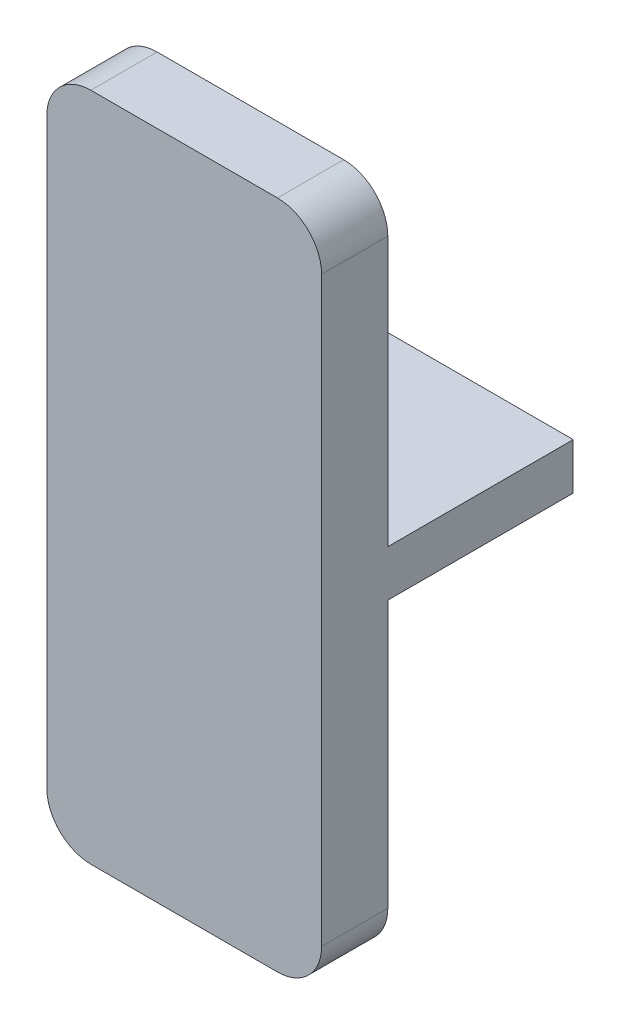
ISO-10303-21;
HEADER;
FILE_DESCRIPTION(('STEP AP214'),'2;1');
FILE_NAME('part.step','',(''),(''),'','','');
FILE_SCHEMA(('AUTOMOTIVE_DESIGN { 1 0 10303 214 1 1 1 1 }'));
ENDSEC;
DATA;
#1=APPLICATION_CONTEXT('core data for automotive mechanical design processes');
#2=APPLICATION_PROTOCOL_DEFINITION('international standard','automotive_design',2000,#1);
#3=PRODUCT_CONTEXT('',#1,'mechanical');
#4=PRODUCT('Part','Part','',(#3));
#5=PRODUCT_RELATED_PRODUCT_CATEGORY('part','',(#4));
#6=PRODUCT_DEFINITION_FORMATION('','',#4);
#7=PRODUCT_DEFINITION_CONTEXT('part definition',#1,'design');
#8=PRODUCT_DEFINITION('design','',#6,#7);
#9=PRODUCT_DEFINITION_SHAPE('','',#8);
#10=(LENGTH_UNIT() NAMED_UNIT(*) SI_UNIT(.MILLI.,.METRE.));
#11=(NAMED_UNIT(*) PLANE_ANGLE_UNIT() SI_UNIT($,.RADIAN.));
#12=(NAMED_UNIT(*) SI_UNIT($,.STERADIAN.) SOLID_ANGLE_UNIT());
#13=UNCERTAINTY_MEASURE_WITH_UNIT(LENGTH_MEASURE(1.E-05),#10,'distance_accuracy_value','');
#14=(GEOMETRIC_REPRESENTATION_CONTEXT(3) GLOBAL_UNCERTAINTY_ASSIGNED_CONTEXT((#13)) GLOBAL_UNIT_ASSIGNED_CONTEXT((#10,
#11,#12)) REPRESENTATION_CONTEXT('',''));
#15=CARTESIAN_POINT('',(0.,0.,0.));
#16=DIRECTION('',(0.,0.,1.));
#17=DIRECTION('',(1.,0.,0.));
#18=AXIS2_PLACEMENT_3D('',#15,#16,#17);
#19=CARTESIAN_POINT('',(0.,0.,8.4));
#20=DIRECTION('',(1.,0.,0.));
#21=DIRECTION('',(0.,0.,-1.));
#22=AXIS2_PLACEMENT_3D('',#19,#20,#21);
#23=PLANE('',#22);
#24=DIRECTION('',(0.,-1.,0.));
#25=VECTOR('',#24,1.);
#26=CARTESIAN_POINT('',(0.,16.2816832821619,8.4));
#27=LINE('',#26,#25);
#28=CARTESIAN_POINT('',(0.,0.,8.4));
#29=VERTEX_POINT('',#28);
#30=CARTESIAN_POINT('',(0.,-12.0863582133201,8.4));
#31=VERTEX_POINT('',#30);
#32=EDGE_CURVE('E132',#29,#31,#27,.T.);
#33=ORIENTED_EDGE('',*,*,#32,.T.);
#34=DIRECTION('',(0.,0.,-1.));
#35=VECTOR('',#34,1.);
#36=CARTESIAN_POINT('',(0.,-12.0863582133201,8.4));
#37=LINE('',#36,#35);
#38=CARTESIAN_POINT('',(0.,-12.0863582133201,11.4));
#39=VERTEX_POINT('',#38);
#40=EDGE_CURVE('E191',#31,#39,#37,.F.);
#41=ORIENTED_EDGE('',*,*,#40,.T.);
#42=DIRECTION('',(0.,-1.,0.));
#43=VECTOR('',#42,1.);
#44=CARTESIAN_POINT('',(0.,16.2816832821619,11.4));
#45=LINE('',#44,#43);
#46=CARTESIAN_POINT('',(0.,14.2816832821619,11.4));
#47=VERTEX_POINT('',#46);
#48=EDGE_CURVE('E217',#47,#39,#45,.T.);
#49=ORIENTED_EDGE('',*,*,#48,.F.);
#50=DIRECTION('',(0.,0.,-1.));
#51=VECTOR('',#50,1.);
#52=CARTESIAN_POINT('',(0.,14.2816832821619,8.4));
#53=LINE('',#52,#51);
#54=CARTESIAN_POINT('',(0.,14.2816832821619,8.4));
#55=VERTEX_POINT('',#54);
#56=EDGE_CURVE('E129',#47,#55,#53,.T.);
#57=ORIENTED_EDGE('',*,*,#56,.T.);
#58=CARTESIAN_POINT('',(0.,2.1,8.4));
#59=VERTEX_POINT('',#58);
#60=EDGE_CURVE('E121',#55,#59,#27,.T.);
#61=ORIENTED_EDGE('',*,*,#60,.T.);
#62=DIRECTION('',(0.,0.,-1.));
#63=VECTOR('',#62,1.);
#64=CARTESIAN_POINT('',(0.,2.1,8.4));
#65=LINE('',#64,#63);
#66=CARTESIAN_POINT('',(0.,2.1,0.));
#67=VERTEX_POINT('',#66);
#68=EDGE_CURVE('E125',#59,#67,#65,.T.);
#69=ORIENTED_EDGE('',*,*,#68,.T.);
#70=DIRECTION('',(0.,-1.,0.));
#71=VECTOR('',#70,1.);
#72=CARTESIAN_POINT('',(0.,0.,0.));
#73=LINE('',#72,#71);
#74=CARTESIAN_POINT('',(0.,0.,0.));
#75=VERTEX_POINT('',#74);
#76=EDGE_CURVE('E153',#67,#75,#73,.T.);
#77=ORIENTED_EDGE('',*,*,#76,.T.);
#78=DIRECTION('',(0.,0.,-1.));
#79=VECTOR('',#78,1.);
#80=CARTESIAN_POINT('',(0.,0.,8.4));
#81=LINE('',#80,#79);
#82=EDGE_CURVE('E165',#29,#75,#81,.T.);
#83=ORIENTED_EDGE('',*,*,#82,.F.);
#84=EDGE_LOOP('',(#33,#41,#49,#57,#61,#69,#77,#83));
#85=FACE_BOUND('',#84,.T.);
#86=ADVANCED_FACE('F33',(#85),#23,.F.);
#87=CARTESIAN_POINT('',(0.,0.,8.4));
#88=DIRECTION('',(0.,1.,0.));
#89=DIRECTION('',(0.,0.,1.));
#90=AXIS2_PLACEMENT_3D('',#87,#88,#89);
#91=PLANE('',#90);
#92=DIRECTION('',(1.,0.,0.));
#93=VECTOR('',#92,1.);
#94=CARTESIAN_POINT('',(0.,0.,0.));
#95=LINE('',#94,#93);
#96=CARTESIAN_POINT('',(12.45,0.,0.));
#97=VERTEX_POINT('',#96);
#98=EDGE_CURVE('E155',#75,#97,#95,.T.);
#99=ORIENTED_EDGE('',*,*,#98,.T.);
#100=DIRECTION('',(0.,0.,-1.));
#101=VECTOR('',#100,1.);
#102=CARTESIAN_POINT('',(12.45,0.,8.4));
#103=LINE('',#102,#101);
#104=CARTESIAN_POINT('',(12.45,0.,8.4));
#105=VERTEX_POINT('',#104);
#106=EDGE_CURVE('E162',#105,#97,#103,.T.);
#107=ORIENTED_EDGE('',*,*,#106,.F.);
#108=DIRECTION('',(1.,0.,0.));
#109=VECTOR('',#108,1.);
#110=CARTESIAN_POINT('',(0.,0.,8.4));
#111=LINE('',#110,#109);
#112=EDGE_CURVE('E147',#29,#105,#111,.T.);
#113=ORIENTED_EDGE('',*,*,#112,.F.);
#114=ORIENTED_EDGE('',*,*,#82,.T.);
#115=EDGE_LOOP('',(#99,#107,#113,#114));
#116=FACE_BOUND('',#115,.T.);
#117=ADVANCED_FACE('F239',(#116),#91,.F.);
#118=CARTESIAN_POINT('',(12.45,0.,8.4));
#119=DIRECTION('',(-1.,0.,0.));
#120=DIRECTION('',(0.,0.,1.));
#121=AXIS2_PLACEMENT_3D('',#118,#119,#120);
#122=PLANE('',#121);
#123=DIRECTION('',(0.,1.,0.));
#124=VECTOR('',#123,1.);
#125=CARTESIAN_POINT('',(12.45,16.2816832821619,11.4));
#126=LINE('',#125,#124);
#127=CARTESIAN_POINT('',(12.45,-12.0863582133201,11.4));
#128=VERTEX_POINT('',#127);
#129=CARTESIAN_POINT('',(12.45,14.2816832821619,11.4));
#130=VERTEX_POINT('',#129);
#131=EDGE_CURVE('E209',#128,#130,#126,.T.);
#132=ORIENTED_EDGE('',*,*,#131,.F.);
#133=DIRECTION('',(0.,0.,-1.));
#134=VECTOR('',#133,1.);
#135=CARTESIAN_POINT('',(12.45,-12.0863582133201,8.4));
#136=LINE('',#135,#134);
#137=CARTESIAN_POINT('',(12.45,-12.0863582133201,8.4));
#138=VERTEX_POINT('',#137);
#139=EDGE_CURVE('E170',#128,#138,#136,.T.);
#140=ORIENTED_EDGE('',*,*,#139,.T.);
#141=DIRECTION('',(0.,1.,0.));
#142=VECTOR('',#141,1.);
#143=CARTESIAN_POINT('',(12.45,16.2816832821619,8.4));
#144=LINE('',#143,#142);
#145=EDGE_CURVE('E204',#138,#105,#144,.T.);
#146=ORIENTED_EDGE('',*,*,#145,.T.);
#147=ORIENTED_EDGE('',*,*,#106,.T.);
#148=DIRECTION('',(0.,1.,0.));
#149=VECTOR('',#148,1.);
#150=CARTESIAN_POINT('',(12.45,0.,0.));
#151=LINE('',#150,#149);
#152=CARTESIAN_POINT('',(12.45,2.1,0.));
#153=VERTEX_POINT('',#152);
#154=EDGE_CURVE('E158',#97,#153,#151,.T.);
#155=ORIENTED_EDGE('',*,*,#154,.T.);
#156=DIRECTION('',(0.,0.,-1.));
#157=VECTOR('',#156,1.);
#158=CARTESIAN_POINT('',(12.45,2.1,8.4));
#159=LINE('',#158,#157);
#160=CARTESIAN_POINT('',(12.45,2.1,8.4));
#161=VERTEX_POINT('',#160);
#162=EDGE_CURVE('E142',#161,#153,#159,.T.);
#163=ORIENTED_EDGE('',*,*,#162,.F.);
#164=CARTESIAN_POINT('',(12.45,14.2816832821619,8.4));
#165=VERTEX_POINT('',#164);
#166=EDGE_CURVE('E146',#161,#165,#144,.T.);
#167=ORIENTED_EDGE('',*,*,#166,.T.);
#168=DIRECTION('',(0.,0.,-1.));
#169=VECTOR('',#168,1.);
#170=CARTESIAN_POINT('',(12.45,14.2816832821619,8.4));
#171=LINE('',#170,#169);
#172=EDGE_CURVE('E168',#165,#130,#171,.F.);
#173=ORIENTED_EDGE('',*,*,#172,.T.);
#174=EDGE_LOOP('',(#132,#140,#146,#147,#155,#163,#167,#173));
#175=FACE_BOUND('',#174,.T.);
#176=ADVANCED_FACE('F232',(#175),#122,.F.);
#177=CARTESIAN_POINT('',(0.,2.1,8.4));
#178=DIRECTION('',(0.,-1.,0.));
#179=DIRECTION('',(0.,0.,-1.));
#180=AXIS2_PLACEMENT_3D('',#177,#178,#179);
#181=PLANE('',#180);
#182=DIRECTION('',(-1.,0.,0.));
#183=VECTOR('',#182,1.);
#184=CARTESIAN_POINT('',(0.,2.1,0.));
#185=LINE('',#184,#183);
#186=EDGE_CURVE('E141',#153,#67,#185,.T.);
#187=ORIENTED_EDGE('',*,*,#186,.T.);
#188=ORIENTED_EDGE('',*,*,#68,.F.);
#189=DIRECTION('',(-1.,0.,0.));
#190=VECTOR('',#189,1.);
#191=CARTESIAN_POINT('',(0.,2.1,8.4));
#192=LINE('',#191,#190);
#193=EDGE_CURVE('E138',#161,#59,#192,.T.);
#194=ORIENTED_EDGE('',*,*,#193,.F.);
#195=ORIENTED_EDGE('',*,*,#162,.T.);
#196=EDGE_LOOP('',(#187,#188,#194,#195));
#197=FACE_BOUND('',#196,.T.);
#198=ADVANCED_FACE('F136',(#197),#181,.F.);
#199=CARTESIAN_POINT('',(0.,0.,0.));
#200=DIRECTION('',(0.,0.,-1.));
#201=DIRECTION('',(-1.,0.,0.));
#202=AXIS2_PLACEMENT_3D('',#199,#200,#201);
#203=PLANE('',#202);
#204=ORIENTED_EDGE('',*,*,#76,.F.);
#205=ORIENTED_EDGE('',*,*,#186,.F.);
#206=ORIENTED_EDGE('',*,*,#154,.F.);
#207=ORIENTED_EDGE('',*,*,#98,.F.);
#208=EDGE_LOOP('',(#204,#205,#206,#207));
#209=FACE_BOUND('',#208,.T.);
#210=ADVANCED_FACE('F242',(#209),#203,.T.);
#211=CARTESIAN_POINT('',(0.,0.,8.4));
#212=DIRECTION('',(0.,0.,1.));
#213=DIRECTION('',(1.,0.,0.));
#214=AXIS2_PLACEMENT_3D('',#211,#212,#213);
#215=PLANE('',#214);
#216=ORIENTED_EDGE('',*,*,#145,.F.);
#217=CARTESIAN_POINT('',(10.45,-12.0863582133201,8.4));
#218=DIRECTION('',(0.,0.,1.));
#219=DIRECTION('',(1.,0.,0.));
#220=AXIS2_PLACEMENT_3D('',#217,#218,#219);
#221=CIRCLE('',#220,2.);
#222=CARTESIAN_POINT('',(10.45,-14.0863582133201,8.4));
#223=VERTEX_POINT('',#222);
#224=EDGE_CURVE('E175',#138,#223,#221,.F.);
#225=ORIENTED_EDGE('',*,*,#224,.T.);
#226=DIRECTION('',(1.,0.,0.));
#227=VECTOR('',#226,1.);
#228=CARTESIAN_POINT('',(0.,-14.0863582133201,8.4));
#229=LINE('',#228,#227);
#230=CARTESIAN_POINT('',(2.,-14.0863582133201,8.4));
#231=VERTEX_POINT('',#230);
#232=EDGE_CURVE('E131',#231,#223,#229,.T.);
#233=ORIENTED_EDGE('',*,*,#232,.F.);
#234=CARTESIAN_POINT('',(2.,-12.0863582133201,8.4));
#235=DIRECTION('',(0.,0.,1.));
#236=DIRECTION('',(1.,0.,0.));
#237=AXIS2_PLACEMENT_3D('',#234,#235,#236);
#238=CIRCLE('',#237,2.);
#239=EDGE_CURVE('E173',#231,#31,#238,.F.);
#240=ORIENTED_EDGE('',*,*,#239,.T.);
#241=ORIENTED_EDGE('',*,*,#32,.F.);
#242=ORIENTED_EDGE('',*,*,#112,.T.);
#243=EDGE_LOOP('',(#216,#225,#233,#240,#241,#242));
#244=FACE_BOUND('',#243,.T.);
#245=ADVANCED_FACE('F235',(#244),#215,.F.);
#246=DIRECTION('',(-1.,0.,0.));
#247=VECTOR('',#246,1.);
#248=CARTESIAN_POINT('',(0.,16.2816832821619,8.4));
#249=LINE('',#248,#247);
#250=CARTESIAN_POINT('',(10.45,16.2816832821619,8.4));
#251=VERTEX_POINT('',#250);
#252=CARTESIAN_POINT('',(2.,16.2816832821619,8.4));
#253=VERTEX_POINT('',#252);
#254=EDGE_CURVE('E199',#251,#253,#249,.T.);
#255=ORIENTED_EDGE('',*,*,#254,.F.);
#256=CARTESIAN_POINT('',(10.45,14.2816832821619,8.4));
#257=DIRECTION('',(0.,0.,1.));
#258=DIRECTION('',(1.,0.,0.));
#259=AXIS2_PLACEMENT_3D('',#256,#257,#258);
#260=CIRCLE('',#259,2.);
#261=EDGE_CURVE('E11',#251,#165,#260,.F.);
#262=ORIENTED_EDGE('',*,*,#261,.T.);
#263=ORIENTED_EDGE('',*,*,#166,.F.);
#264=ORIENTED_EDGE('',*,*,#193,.T.);
#265=ORIENTED_EDGE('',*,*,#60,.F.);
#266=CARTESIAN_POINT('',(2.,14.2816832821619,8.4));
#267=DIRECTION('',(0.,0.,1.));
#268=DIRECTION('',(1.,0.,0.));
#269=AXIS2_PLACEMENT_3D('',#266,#267,#268);
#270=CIRCLE('',#269,2.);
#271=EDGE_CURVE('E41',#55,#253,#270,.F.);
#272=ORIENTED_EDGE('',*,*,#271,.T.);
#273=EDGE_LOOP('',(#255,#262,#263,#264,#265,#272));
#274=FACE_BOUND('',#273,.T.);
#275=ADVANCED_FACE('F144',(#274),#215,.F.);
#276=CARTESIAN_POINT('',(0.,16.2816832821619,11.4));
#277=DIRECTION('',(0.,-1.,0.));
#278=DIRECTION('',(0.,0.,-1.));
#279=AXIS2_PLACEMENT_3D('',#276,#277,#278);
#280=PLANE('',#279);
#281=DIRECTION('',(-1.,0.,0.));
#282=VECTOR('',#281,1.);
#283=CARTESIAN_POINT('',(0.,16.2816832821619,11.4));
#284=LINE('',#283,#282);
#285=CARTESIAN_POINT('',(10.45,16.2816832821619,11.4));
#286=VERTEX_POINT('',#285);
#287=CARTESIAN_POINT('',(2.,16.2816832821619,11.4));
#288=VERTEX_POINT('',#287);
#289=EDGE_CURVE('E202',#286,#288,#284,.T.);
#290=ORIENTED_EDGE('',*,*,#289,.F.);
#291=DIRECTION('',(0.,0.,-1.));
#292=VECTOR('',#291,1.);
#293=CARTESIAN_POINT('',(10.45,16.2816832821619,11.4));
#294=LINE('',#293,#292);
#295=EDGE_CURVE('E195',#286,#251,#294,.T.);
#296=ORIENTED_EDGE('',*,*,#295,.T.);
#297=ORIENTED_EDGE('',*,*,#254,.T.);
#298=DIRECTION('',(0.,0.,-1.));
#299=VECTOR('',#298,1.);
#300=CARTESIAN_POINT('',(2.,16.2816832821619,11.4));
#301=LINE('',#300,#299);
#302=EDGE_CURVE('E193',#253,#288,#301,.F.);
#303=ORIENTED_EDGE('',*,*,#302,.T.);
#304=EDGE_LOOP('',(#290,#296,#297,#303));
#305=FACE_BOUND('',#304,.T.);
#306=ADVANCED_FACE('F198',(#305),#280,.F.);
#307=CARTESIAN_POINT('',(0.,-14.0863582133201,11.4));
#308=DIRECTION('',(0.,1.,0.));
#309=DIRECTION('',(0.,0.,1.));
#310=AXIS2_PLACEMENT_3D('',#307,#308,#309);
#311=PLANE('',#310);
#312=ORIENTED_EDGE('',*,*,#232,.T.);
#313=DIRECTION('',(0.,0.,-1.));
#314=VECTOR('',#313,1.);
#315=CARTESIAN_POINT('',(10.45,-14.0863582133201,11.4));
#316=LINE('',#315,#314);
#317=CARTESIAN_POINT('',(10.45,-14.0863582133201,11.4));
#318=VERTEX_POINT('',#317);
#319=EDGE_CURVE('E180',#223,#318,#316,.F.);
#320=ORIENTED_EDGE('',*,*,#319,.T.);
#321=DIRECTION('',(1.,0.,0.));
#322=VECTOR('',#321,1.);
#323=CARTESIAN_POINT('',(0.,-14.0863582133201,11.4));
#324=LINE('',#323,#322);
#325=CARTESIAN_POINT('',(2.,-14.0863582133201,11.4));
#326=VERTEX_POINT('',#325);
#327=EDGE_CURVE('E156',#326,#318,#324,.T.);
#328=ORIENTED_EDGE('',*,*,#327,.F.);
#329=DIRECTION('',(0.,0.,-1.));
#330=VECTOR('',#329,1.);
#331=CARTESIAN_POINT('',(2.,-14.0863582133201,11.4));
#332=LINE('',#331,#330);
#333=EDGE_CURVE('E177',#326,#231,#332,.T.);
#334=ORIENTED_EDGE('',*,*,#333,.T.);
#335=EDGE_LOOP('',(#312,#320,#328,#334));
#336=FACE_BOUND('',#335,.T.);
#337=ADVANCED_FACE('F266',(#336),#311,.F.);
#338=CARTESIAN_POINT('',(0.,0.,11.4));
#339=DIRECTION('',(0.,0.,1.));
#340=DIRECTION('',(1.,0.,0.));
#341=AXIS2_PLACEMENT_3D('',#338,#339,#340);
#342=PLANE('',#341);
#343=ORIENTED_EDGE('',*,*,#327,.T.);
#344=CARTESIAN_POINT('',(10.45,-12.0863582133201,11.4));
#345=DIRECTION('',(0.,0.,1.));
#346=DIRECTION('',(1.,0.,0.));
#347=AXIS2_PLACEMENT_3D('',#344,#345,#346);
#348=CIRCLE('',#347,2.);
#349=EDGE_CURVE('E188',#318,#128,#348,.T.);
#350=ORIENTED_EDGE('',*,*,#349,.T.);
#351=ORIENTED_EDGE('',*,*,#131,.T.);
#352=CARTESIAN_POINT('',(10.45,14.2816832821619,11.4));
#353=DIRECTION('',(0.,0.,1.));
#354=DIRECTION('',(1.,0.,0.));
#355=AXIS2_PLACEMENT_3D('',#352,#353,#354);
#356=CIRCLE('',#355,2.);
#357=EDGE_CURVE('E184',#130,#286,#356,.T.);
#358=ORIENTED_EDGE('',*,*,#357,.T.);
#359=ORIENTED_EDGE('',*,*,#289,.T.);
#360=CARTESIAN_POINT('',(2.,14.2816832821619,11.4));
#361=DIRECTION('',(0.,0.,1.));
#362=DIRECTION('',(1.,0.,0.));
#363=AXIS2_PLACEMENT_3D('',#360,#361,#362);
#364=CIRCLE('',#363,2.);
#365=EDGE_CURVE('E182',#288,#47,#364,.T.);
#366=ORIENTED_EDGE('',*,*,#365,.T.);
#367=ORIENTED_EDGE('',*,*,#48,.T.);
#368=CARTESIAN_POINT('',(2.,-12.0863582133201,11.4));
#369=DIRECTION('',(0.,0.,1.));
#370=DIRECTION('',(1.,0.,0.));
#371=AXIS2_PLACEMENT_3D('',#368,#369,#370);
#372=CIRCLE('',#371,2.);
#373=EDGE_CURVE('E186',#39,#326,#372,.T.);
#374=ORIENTED_EDGE('',*,*,#373,.T.);
#375=EDGE_LOOP('',(#343,#350,#351,#358,#359,#366,#367,#374));
#376=FACE_BOUND('',#375,.T.);
#377=ADVANCED_FACE('F224',(#376),#342,.T.);
#378=CARTESIAN_POINT('',(10.45,-12.0863582133201,8.4));
#379=DIRECTION('',(0.,0.,-1.));
#380=DIRECTION('',(-1.,0.,0.));
#381=AXIS2_PLACEMENT_3D('',#378,#379,#380);
#382=CYLINDRICAL_SURFACE('',#381,2.);
#383=ORIENTED_EDGE('',*,*,#349,.F.);
#384=ORIENTED_EDGE('',*,*,#319,.F.);
#385=ORIENTED_EDGE('',*,*,#224,.F.);
#386=ORIENTED_EDGE('',*,*,#139,.F.);
#387=EDGE_LOOP('',(#383,#384,#385,#386));
#388=FACE_BOUND('',#387,.T.);
#389=ADVANCED_FACE('F229',(#388),#382,.T.);
#390=CARTESIAN_POINT('',(2.,-12.0863582133201,11.4));
#391=DIRECTION('',(0.,0.,-1.));
#392=DIRECTION('',(-1.,0.,0.));
#393=AXIS2_PLACEMENT_3D('',#390,#391,#392);
#394=CYLINDRICAL_SURFACE('',#393,2.);
#395=ORIENTED_EDGE('',*,*,#373,.F.);
#396=ORIENTED_EDGE('',*,*,#40,.F.);
#397=ORIENTED_EDGE('',*,*,#239,.F.);
#398=ORIENTED_EDGE('',*,*,#333,.F.);
#399=EDGE_LOOP('',(#395,#396,#397,#398));
#400=FACE_BOUND('',#399,.T.);
#401=ADVANCED_FACE('F251',(#400),#394,.T.);
#402=CARTESIAN_POINT('',(10.45,14.2816832821619,11.4));
#403=DIRECTION('',(0.,0.,-1.));
#404=DIRECTION('',(-1.,0.,0.));
#405=AXIS2_PLACEMENT_3D('',#402,#403,#404);
#406=CYLINDRICAL_SURFACE('',#405,2.);
#407=ORIENTED_EDGE('',*,*,#357,.F.);
#408=ORIENTED_EDGE('',*,*,#172,.F.);
#409=ORIENTED_EDGE('',*,*,#261,.F.);
#410=ORIENTED_EDGE('',*,*,#295,.F.);
#411=EDGE_LOOP('',(#407,#408,#409,#410));
#412=FACE_BOUND('',#411,.T.);
#413=ADVANCED_FACE('F244',(#412),#406,.T.);
#414=CARTESIAN_POINT('',(2.,14.2816832821619,8.4));
#415=DIRECTION('',(0.,0.,-1.));
#416=DIRECTION('',(-1.,0.,0.));
#417=AXIS2_PLACEMENT_3D('',#414,#415,#416);
#418=CYLINDRICAL_SURFACE('',#417,2.);
#419=ORIENTED_EDGE('',*,*,#365,.F.);
#420=ORIENTED_EDGE('',*,*,#302,.F.);
#421=ORIENTED_EDGE('',*,*,#271,.F.);
#422=ORIENTED_EDGE('',*,*,#56,.F.);
#423=EDGE_LOOP('',(#419,#420,#421,#422));
#424=FACE_BOUND('',#423,.T.);
#425=ADVANCED_FACE('F35',(#424),#418,.T.);
#426=CLOSED_SHELL('',(#86,#117,#176,#198,#210,#245,#275,#306,#337,#377,#389,#401,#413,#425));
#427=MANIFOLD_SOLID_BREP('B2',#426);
#428=ADVANCED_BREP_SHAPE_REPRESENTATION('',(#18,#427),#14);
#429=SHAPE_DEFINITION_REPRESENTATION(#9,#428);
ENDSEC;
END-ISO-10303-21;
